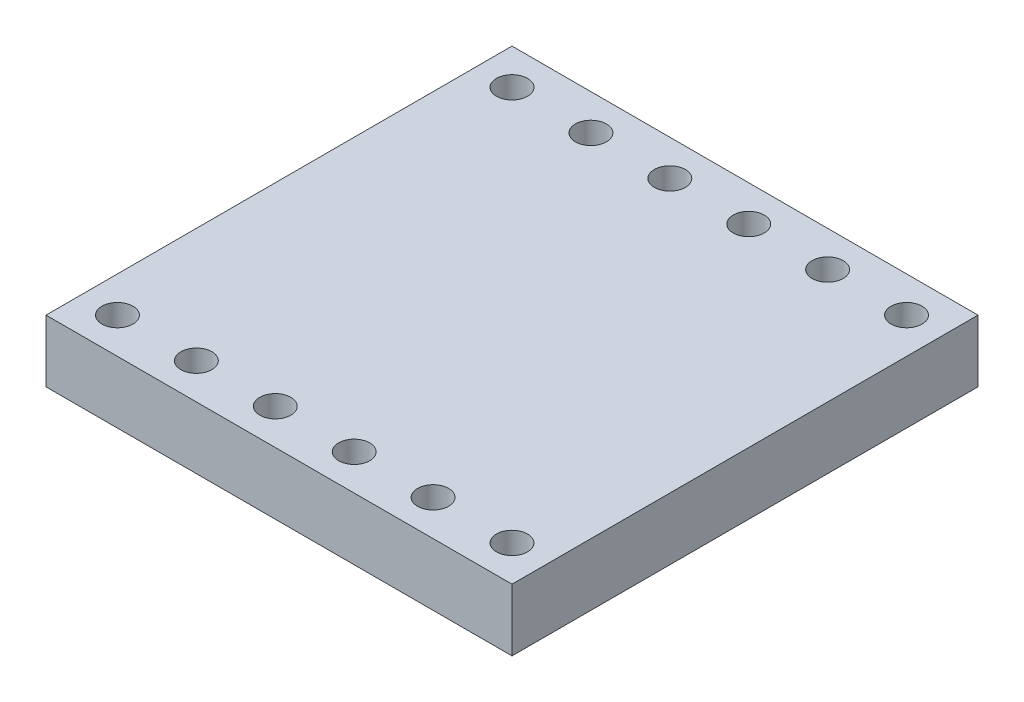
ISO-10303-21;
HEADER;
FILE_DESCRIPTION(('STEP AP214'),'2;1');
FILE_NAME('part.step','',(''),(''),'','','');
FILE_SCHEMA(('AUTOMOTIVE_DESIGN { 1 0 10303 214 1 1 1 1 }'));
ENDSEC;
DATA;
#1=APPLICATION_CONTEXT('core data for automotive mechanical design processes');
#2=APPLICATION_PROTOCOL_DEFINITION('international standard','automotive_design',2000,#1);
#3=PRODUCT_CONTEXT('',#1,'mechanical');
#4=PRODUCT('Part','Part','',(#3));
#5=PRODUCT_RELATED_PRODUCT_CATEGORY('part','',(#4));
#6=PRODUCT_DEFINITION_FORMATION('','',#4);
#7=PRODUCT_DEFINITION_CONTEXT('part definition',#1,'design');
#8=PRODUCT_DEFINITION('design','',#6,#7);
#9=PRODUCT_DEFINITION_SHAPE('','',#8);
#10=(LENGTH_UNIT() NAMED_UNIT(*) SI_UNIT(.MILLI.,.METRE.));
#11=(NAMED_UNIT(*) PLANE_ANGLE_UNIT() SI_UNIT($,.RADIAN.));
#12=(NAMED_UNIT(*) SI_UNIT($,.STERADIAN.) SOLID_ANGLE_UNIT());
#13=UNCERTAINTY_MEASURE_WITH_UNIT(LENGTH_MEASURE(1.E-05),#10,'distance_accuracy_value','');
#14=(GEOMETRIC_REPRESENTATION_CONTEXT(3) GLOBAL_UNCERTAINTY_ASSIGNED_CONTEXT((#13)) GLOBAL_UNIT_ASSIGNED_CONTEXT((#10,
#11,#12)) REPRESENTATION_CONTEXT('',''));
#15=CARTESIAN_POINT('',(0.,0.,0.));
#16=DIRECTION('',(0.,0.,1.));
#17=DIRECTION('',(1.,0.,0.));
#18=AXIS2_PLACEMENT_3D('',#15,#16,#17);
#19=CARTESIAN_POINT('',(0.,2.,0.));
#20=DIRECTION('',(1.,0.,0.));
#21=DIRECTION('',(0.,0.,-1.));
#22=AXIS2_PLACEMENT_3D('',#19,#20,#21);
#23=PLANE('',#22);
#24=DIRECTION('',(0.,0.,1.));
#25=VECTOR('',#24,1.);
#26=CARTESIAN_POINT('',(0.,0.,0.));
#27=LINE('',#26,#25);
#28=CARTESIAN_POINT('',(0.,0.,-15.));
#29=VERTEX_POINT('',#28);
#30=CARTESIAN_POINT('',(0.,0.,0.));
#31=VERTEX_POINT('',#30);
#32=EDGE_CURVE('E106',#29,#31,#27,.T.);
#33=ORIENTED_EDGE('',*,*,#32,.T.);
#34=DIRECTION('',(0.,-1.,0.));
#35=VECTOR('',#34,1.);
#36=CARTESIAN_POINT('',(0.,2.,0.));
#37=LINE('',#36,#35);
#38=CARTESIAN_POINT('',(0.,2.,0.));
#39=VERTEX_POINT('',#38);
#40=EDGE_CURVE('E11',#39,#31,#37,.T.);
#41=ORIENTED_EDGE('',*,*,#40,.F.);
#42=DIRECTION('',(0.,0.,1.));
#43=VECTOR('',#42,1.);
#44=CARTESIAN_POINT('',(0.,2.,0.));
#45=LINE('',#44,#43);
#46=CARTESIAN_POINT('',(0.,2.,-15.));
#47=VERTEX_POINT('',#46);
#48=EDGE_CURVE('E90',#47,#39,#45,.T.);
#49=ORIENTED_EDGE('',*,*,#48,.F.);
#50=DIRECTION('',(0.,-1.,0.));
#51=VECTOR('',#50,1.);
#52=CARTESIAN_POINT('',(0.,2.,-15.));
#53=LINE('',#52,#51);
#54=EDGE_CURVE('E102',#47,#29,#53,.T.);
#55=ORIENTED_EDGE('',*,*,#54,.T.);
#56=EDGE_LOOP('',(#33,#41,#49,#55));
#57=FACE_BOUND('',#56,.T.);
#58=ADVANCED_FACE('F38',(#57),#23,.F.);
#59=CARTESIAN_POINT('',(0.,2.,0.));
#60=DIRECTION('',(0.,0.,-1.));
#61=DIRECTION('',(-1.,0.,0.));
#62=AXIS2_PLACEMENT_3D('',#59,#60,#61);
#63=PLANE('',#62);
#64=DIRECTION('',(1.,0.,0.));
#65=VECTOR('',#64,1.);
#66=CARTESIAN_POINT('',(0.,0.,0.));
#67=LINE('',#66,#65);
#68=CARTESIAN_POINT('',(15.,0.,0.));
#69=VERTEX_POINT('',#68);
#70=EDGE_CURVE('E95',#31,#69,#67,.T.);
#71=ORIENTED_EDGE('',*,*,#70,.T.);
#72=DIRECTION('',(0.,-1.,0.));
#73=VECTOR('',#72,1.);
#74=CARTESIAN_POINT('',(15.,2.,0.));
#75=LINE('',#74,#73);
#76=CARTESIAN_POINT('',(15.,2.,0.));
#77=VERTEX_POINT('',#76);
#78=EDGE_CURVE('E47',#77,#69,#75,.T.);
#79=ORIENTED_EDGE('',*,*,#78,.F.);
#80=DIRECTION('',(1.,0.,0.));
#81=VECTOR('',#80,1.);
#82=CARTESIAN_POINT('',(0.,2.,0.));
#83=LINE('',#82,#81);
#84=EDGE_CURVE('E85',#39,#77,#83,.T.);
#85=ORIENTED_EDGE('',*,*,#84,.F.);
#86=ORIENTED_EDGE('',*,*,#40,.T.);
#87=EDGE_LOOP('',(#71,#79,#85,#86));
#88=FACE_BOUND('',#87,.T.);
#89=ADVANCED_FACE('F94',(#88),#63,.F.);
#90=CARTESIAN_POINT('',(15.,2.,0.));
#91=DIRECTION('',(-1.,0.,0.));
#92=DIRECTION('',(0.,0.,1.));
#93=AXIS2_PLACEMENT_3D('',#90,#91,#92);
#94=PLANE('',#93);
#95=DIRECTION('',(0.,0.,-1.));
#96=VECTOR('',#95,1.);
#97=CARTESIAN_POINT('',(15.,0.,0.));
#98=LINE('',#97,#96);
#99=CARTESIAN_POINT('',(15.,0.,-15.));
#100=VERTEX_POINT('',#99);
#101=EDGE_CURVE('E72',#69,#100,#98,.T.);
#102=ORIENTED_EDGE('',*,*,#101,.T.);
#103=DIRECTION('',(0.,-1.,0.));
#104=VECTOR('',#103,1.);
#105=CARTESIAN_POINT('',(15.,2.,-15.));
#106=LINE('',#105,#104);
#107=CARTESIAN_POINT('',(15.,2.,-15.));
#108=VERTEX_POINT('',#107);
#109=EDGE_CURVE('E97',#108,#100,#106,.T.);
#110=ORIENTED_EDGE('',*,*,#109,.F.);
#111=DIRECTION('',(0.,0.,-1.));
#112=VECTOR('',#111,1.);
#113=CARTESIAN_POINT('',(15.,2.,0.));
#114=LINE('',#113,#112);
#115=EDGE_CURVE('E88',#77,#108,#114,.T.);
#116=ORIENTED_EDGE('',*,*,#115,.F.);
#117=ORIENTED_EDGE('',*,*,#78,.T.);
#118=EDGE_LOOP('',(#102,#110,#116,#117));
#119=FACE_BOUND('',#118,.T.);
#120=ADVANCED_FACE('F98',(#119),#94,.F.);
#121=CARTESIAN_POINT('',(0.,2.,-15.));
#122=DIRECTION('',(0.,0.,1.));
#123=DIRECTION('',(1.,0.,0.));
#124=AXIS2_PLACEMENT_3D('',#121,#122,#123);
#125=PLANE('',#124);
#126=DIRECTION('',(-1.,0.,0.));
#127=VECTOR('',#126,1.);
#128=CARTESIAN_POINT('',(0.,0.,-15.));
#129=LINE('',#128,#127);
#130=EDGE_CURVE('E78',#100,#29,#129,.T.);
#131=ORIENTED_EDGE('',*,*,#130,.T.);
#132=ORIENTED_EDGE('',*,*,#54,.F.);
#133=DIRECTION('',(-1.,0.,0.));
#134=VECTOR('',#133,1.);
#135=CARTESIAN_POINT('',(0.,2.,-15.));
#136=LINE('',#135,#134);
#137=EDGE_CURVE('E55',#108,#47,#136,.T.);
#138=ORIENTED_EDGE('',*,*,#137,.F.);
#139=ORIENTED_EDGE('',*,*,#109,.T.);
#140=EDGE_LOOP('',(#131,#132,#138,#139));
#141=FACE_BOUND('',#140,.T.);
#142=ADVANCED_FACE('F120',(#141),#125,.F.);
#143=CARTESIAN_POINT('',(0.,2.,0.));
#144=DIRECTION('',(0.,-1.,0.));
#145=DIRECTION('',(0.,0.,-1.));
#146=AXIS2_PLACEMENT_3D('',#143,#144,#145);
#147=PLANE('',#146);
#148=CARTESIAN_POINT('',(1.15,2.,-1.15));
#149=DIRECTION('',(0.,1.,0.));
#150=DIRECTION('',(0.,0.,1.));
#151=AXIS2_PLACEMENT_3D('',#148,#149,#150);
#152=CIRCLE('',#151,0.5);
#153=CARTESIAN_POINT('',(1.15,2.,-0.65));
#154=VERTEX_POINT('',#153);
#155=EDGE_CURVE('E171',#154,#154,#152,.T.);
#156=ORIENTED_EDGE('',*,*,#155,.F.);
#157=EDGE_LOOP('',(#156));
#158=FACE_BOUND('',#157,.T.);
#159=CARTESIAN_POINT('',(13.85,2.,-13.85));
#160=DIRECTION('',(0.,1.,0.));
#161=DIRECTION('',(0.,0.,1.));
#162=AXIS2_PLACEMENT_3D('',#159,#160,#161);
#163=CIRCLE('',#162,0.500000000000001);
#164=CARTESIAN_POINT('',(13.85,2.,-13.35));
#165=VERTEX_POINT('',#164);
#166=EDGE_CURVE('E172',#165,#165,#163,.T.);
#167=ORIENTED_EDGE('',*,*,#166,.F.);
#168=EDGE_LOOP('',(#167));
#169=FACE_BOUND('',#168,.T.);
#170=CARTESIAN_POINT('',(11.31,2.,-13.85));
#171=DIRECTION('',(0.,1.,0.));
#172=DIRECTION('',(0.,0.,1.));
#173=AXIS2_PLACEMENT_3D('',#170,#171,#172);
#174=CIRCLE('',#173,0.500000000000001);
#175=CARTESIAN_POINT('',(11.31,2.,-13.35));
#176=VERTEX_POINT('',#175);
#177=EDGE_CURVE('E187',#176,#176,#174,.T.);
#178=ORIENTED_EDGE('',*,*,#177,.F.);
#179=EDGE_LOOP('',(#178));
#180=FACE_BOUND('',#179,.T.);
#181=CARTESIAN_POINT('',(8.77,2.,-13.85));
#182=DIRECTION('',(0.,1.,0.));
#183=DIRECTION('',(0.,0.,1.));
#184=AXIS2_PLACEMENT_3D('',#181,#182,#183);
#185=CIRCLE('',#184,0.500000000000001);
#186=CARTESIAN_POINT('',(8.77,2.,-13.35));
#187=VERTEX_POINT('',#186);
#188=EDGE_CURVE('E188',#187,#187,#185,.T.);
#189=ORIENTED_EDGE('',*,*,#188,.F.);
#190=EDGE_LOOP('',(#189));
#191=FACE_BOUND('',#190,.T.);
#192=CARTESIAN_POINT('',(3.69,2.,-1.15));
#193=DIRECTION('',(0.,1.,0.));
#194=DIRECTION('',(0.,0.,1.));
#195=AXIS2_PLACEMENT_3D('',#192,#193,#194);
#196=CIRCLE('',#195,0.500000000000001);
#197=CARTESIAN_POINT('',(3.69,2.,-0.65));
#198=VERTEX_POINT('',#197);
#199=EDGE_CURVE('E140',#198,#198,#196,.T.);
#200=ORIENTED_EDGE('',*,*,#199,.F.);
#201=EDGE_LOOP('',(#200));
#202=FACE_BOUND('',#201,.T.);
#203=CARTESIAN_POINT('',(6.23,2.,-1.15));
#204=DIRECTION('',(0.,1.,0.));
#205=DIRECTION('',(0.,0.,1.));
#206=AXIS2_PLACEMENT_3D('',#203,#204,#205);
#207=CIRCLE('',#206,0.500000000000001);
#208=CARTESIAN_POINT('',(6.23,2.,-0.65));
#209=VERTEX_POINT('',#208);
#210=EDGE_CURVE('E139',#209,#209,#207,.T.);
#211=ORIENTED_EDGE('',*,*,#210,.F.);
#212=EDGE_LOOP('',(#211));
#213=FACE_BOUND('',#212,.T.);
#214=CARTESIAN_POINT('',(8.77,2.,-1.15));
#215=DIRECTION('',(0.,1.,0.));
#216=DIRECTION('',(0.,0.,1.));
#217=AXIS2_PLACEMENT_3D('',#214,#215,#216);
#218=CIRCLE('',#217,0.500000000000001);
#219=CARTESIAN_POINT('',(8.77,2.,-0.65));
#220=VERTEX_POINT('',#219);
#221=EDGE_CURVE('E149',#220,#220,#218,.T.);
#222=ORIENTED_EDGE('',*,*,#221,.F.);
#223=EDGE_LOOP('',(#222));
#224=FACE_BOUND('',#223,.T.);
#225=CARTESIAN_POINT('',(11.31,2.,-1.15));
#226=DIRECTION('',(0.,1.,0.));
#227=DIRECTION('',(0.,0.,1.));
#228=AXIS2_PLACEMENT_3D('',#225,#226,#227);
#229=CIRCLE('',#228,0.500000000000001);
#230=CARTESIAN_POINT('',(11.31,2.,-0.65));
#231=VERTEX_POINT('',#230);
#232=EDGE_CURVE('E157',#231,#231,#229,.T.);
#233=ORIENTED_EDGE('',*,*,#232,.F.);
#234=EDGE_LOOP('',(#233));
#235=FACE_BOUND('',#234,.T.);
#236=CARTESIAN_POINT('',(6.23,2.,-13.85));
#237=DIRECTION('',(0.,1.,0.));
#238=DIRECTION('',(0.,0.,1.));
#239=AXIS2_PLACEMENT_3D('',#236,#237,#238);
#240=CIRCLE('',#239,0.500000000000001);
#241=CARTESIAN_POINT('',(6.23,2.,-13.35));
#242=VERTEX_POINT('',#241);
#243=EDGE_CURVE('E212',#242,#242,#240,.T.);
#244=ORIENTED_EDGE('',*,*,#243,.F.);
#245=EDGE_LOOP('',(#244));
#246=FACE_BOUND('',#245,.T.);
#247=CARTESIAN_POINT('',(3.69,2.,-13.85));
#248=DIRECTION('',(0.,1.,0.));
#249=DIRECTION('',(0.,0.,1.));
#250=AXIS2_PLACEMENT_3D('',#247,#248,#249);
#251=CIRCLE('',#250,0.500000000000001);
#252=CARTESIAN_POINT('',(3.69,2.,-13.35));
#253=VERTEX_POINT('',#252);
#254=EDGE_CURVE('E203',#253,#253,#251,.T.);
#255=ORIENTED_EDGE('',*,*,#254,.F.);
#256=EDGE_LOOP('',(#255));
#257=FACE_BOUND('',#256,.T.);
#258=CARTESIAN_POINT('',(1.15,2.,-13.85));
#259=DIRECTION('',(0.,1.,0.));
#260=DIRECTION('',(0.,0.,1.));
#261=AXIS2_PLACEMENT_3D('',#258,#259,#260);
#262=CIRCLE('',#261,0.5);
#263=CARTESIAN_POINT('',(1.15,2.,-13.35));
#264=VERTEX_POINT('',#263);
#265=EDGE_CURVE('E204',#264,#264,#262,.T.);
#266=ORIENTED_EDGE('',*,*,#265,.F.);
#267=EDGE_LOOP('',(#266));
#268=FACE_BOUND('',#267,.T.);
#269=CARTESIAN_POINT('',(13.85,2.,-1.15));
#270=DIRECTION('',(0.,1.,0.));
#271=DIRECTION('',(0.,0.,1.));
#272=AXIS2_PLACEMENT_3D('',#269,#270,#271);
#273=CIRCLE('',#272,0.500000000000001);
#274=CARTESIAN_POINT('',(13.85,2.,-0.65));
#275=VERTEX_POINT('',#274);
#276=EDGE_CURVE('E130',#275,#275,#273,.T.);
#277=ORIENTED_EDGE('',*,*,#276,.F.);
#278=EDGE_LOOP('',(#277));
#279=FACE_BOUND('',#278,.T.);
#280=ORIENTED_EDGE('',*,*,#48,.T.);
#281=ORIENTED_EDGE('',*,*,#84,.T.);
#282=ORIENTED_EDGE('',*,*,#115,.T.);
#283=ORIENTED_EDGE('',*,*,#137,.T.);
#284=EDGE_LOOP('',(#280,#281,#282,#283));
#285=FACE_BOUND('',#284,.T.);
#286=ADVANCED_FACE('F86',(#158,#169,#180,#191,#202,#213,#224,#235,#246,#257,#268,#279,#285),
#147,.F.);
#287=CARTESIAN_POINT('',(0.,0.,0.));
#288=DIRECTION('',(0.,-1.,0.));
#289=DIRECTION('',(0.,0.,-1.));
#290=AXIS2_PLACEMENT_3D('',#287,#288,#289);
#291=PLANE('',#290);
#292=CARTESIAN_POINT('',(1.15,0.,-1.15));
#293=DIRECTION('',(0.,-1.,0.));
#294=DIRECTION('',(0.,0.,-1.));
#295=AXIS2_PLACEMENT_3D('',#292,#293,#294);
#296=CIRCLE('',#295,0.5);
#297=CARTESIAN_POINT('',(1.15,0.,-1.65));
#298=VERTEX_POINT('',#297);
#299=EDGE_CURVE('E144',#298,#298,#296,.F.);
#300=ORIENTED_EDGE('',*,*,#299,.T.);
#301=EDGE_LOOP('',(#300));
#302=FACE_BOUND('',#301,.T.);
#303=CARTESIAN_POINT('',(13.85,0.,-13.85));
#304=DIRECTION('',(0.,-1.,0.));
#305=DIRECTION('',(0.,0.,-1.));
#306=AXIS2_PLACEMENT_3D('',#303,#304,#305);
#307=CIRCLE('',#306,0.500000000000001);
#308=CARTESIAN_POINT('',(13.85,0.,-14.35));
#309=VERTEX_POINT('',#308);
#310=EDGE_CURVE('E167',#309,#309,#307,.F.);
#311=ORIENTED_EDGE('',*,*,#310,.T.);
#312=EDGE_LOOP('',(#311));
#313=FACE_BOUND('',#312,.T.);
#314=CARTESIAN_POINT('',(11.31,0.,-13.85));
#315=DIRECTION('',(0.,-1.,0.));
#316=DIRECTION('',(0.,0.,-1.));
#317=AXIS2_PLACEMENT_3D('',#314,#315,#316);
#318=CIRCLE('',#317,0.500000000000001);
#319=CARTESIAN_POINT('',(11.31,0.,-14.35));
#320=VERTEX_POINT('',#319);
#321=EDGE_CURVE('E176',#320,#320,#318,.F.);
#322=ORIENTED_EDGE('',*,*,#321,.T.);
#323=EDGE_LOOP('',(#322));
#324=FACE_BOUND('',#323,.T.);
#325=CARTESIAN_POINT('',(8.77,0.,-13.85));
#326=DIRECTION('',(0.,-1.,0.));
#327=DIRECTION('',(0.,0.,-1.));
#328=AXIS2_PLACEMENT_3D('',#325,#326,#327);
#329=CIRCLE('',#328,0.500000000000001);
#330=CARTESIAN_POINT('',(8.77,0.,-14.35));
#331=VERTEX_POINT('',#330);
#332=EDGE_CURVE('E183',#331,#331,#329,.F.);
#333=ORIENTED_EDGE('',*,*,#332,.T.);
#334=EDGE_LOOP('',(#333));
#335=FACE_BOUND('',#334,.T.);
#336=CARTESIAN_POINT('',(3.69,0.,-1.15));
#337=DIRECTION('',(0.,-1.,0.));
#338=DIRECTION('',(0.,0.,-1.));
#339=AXIS2_PLACEMENT_3D('',#336,#337,#338);
#340=CIRCLE('',#339,0.500000000000001);
#341=CARTESIAN_POINT('',(3.69,0.,-1.65));
#342=VERTEX_POINT('',#341);
#343=EDGE_CURVE('E135',#342,#342,#340,.F.);
#344=ORIENTED_EDGE('',*,*,#343,.T.);
#345=EDGE_LOOP('',(#344));
#346=FACE_BOUND('',#345,.T.);
#347=CARTESIAN_POINT('',(6.23,0.,-1.15));
#348=DIRECTION('',(0.,-1.,0.));
#349=DIRECTION('',(0.,0.,-1.));
#350=AXIS2_PLACEMENT_3D('',#347,#348,#349);
#351=CIRCLE('',#350,0.500000000000001);
#352=CARTESIAN_POINT('',(6.23,0.,-1.65));
#353=VERTEX_POINT('',#352);
#354=EDGE_CURVE('E145',#353,#353,#351,.F.);
#355=ORIENTED_EDGE('',*,*,#354,.T.);
#356=EDGE_LOOP('',(#355));
#357=FACE_BOUND('',#356,.T.);
#358=CARTESIAN_POINT('',(8.77,0.,-1.15));
#359=DIRECTION('',(0.,-1.,0.));
#360=DIRECTION('',(0.,0.,-1.));
#361=AXIS2_PLACEMENT_3D('',#358,#359,#360);
#362=CIRCLE('',#361,0.500000000000001);
#363=CARTESIAN_POINT('',(8.77,0.,-1.65));
#364=VERTEX_POINT('',#363);
#365=EDGE_CURVE('E153',#364,#364,#362,.F.);
#366=ORIENTED_EDGE('',*,*,#365,.T.);
#367=EDGE_LOOP('',(#366));
#368=FACE_BOUND('',#367,.T.);
#369=CARTESIAN_POINT('',(11.31,0.,-1.15));
#370=DIRECTION('',(0.,-1.,0.));
#371=DIRECTION('',(0.,0.,-1.));
#372=AXIS2_PLACEMENT_3D('',#369,#370,#371);
#373=CIRCLE('',#372,0.500000000000001);
#374=CARTESIAN_POINT('',(11.31,0.,-1.65));
#375=VERTEX_POINT('',#374);
#376=EDGE_CURVE('E134',#375,#375,#373,.F.);
#377=ORIENTED_EDGE('',*,*,#376,.T.);
#378=EDGE_LOOP('',(#377));
#379=FACE_BOUND('',#378,.T.);
#380=CARTESIAN_POINT('',(6.23,0.,-13.85));
#381=DIRECTION('',(0.,-1.,0.));
#382=DIRECTION('',(0.,0.,-1.));
#383=AXIS2_PLACEMENT_3D('',#380,#381,#382);
#384=CIRCLE('',#383,0.500000000000001);
#385=CARTESIAN_POINT('',(6.23,0.,-14.35));
#386=VERTEX_POINT('',#385);
#387=EDGE_CURVE('E192',#386,#386,#384,.F.);
#388=ORIENTED_EDGE('',*,*,#387,.T.);
#389=EDGE_LOOP('',(#388));
#390=FACE_BOUND('',#389,.T.);
#391=CARTESIAN_POINT('',(3.69,0.,-13.85));
#392=DIRECTION('',(0.,-1.,0.));
#393=DIRECTION('',(0.,0.,-1.));
#394=AXIS2_PLACEMENT_3D('',#391,#392,#393);
#395=CIRCLE('',#394,0.500000000000001);
#396=CARTESIAN_POINT('',(3.69,0.,-14.35));
#397=VERTEX_POINT('',#396);
#398=EDGE_CURVE('E208',#397,#397,#395,.F.);
#399=ORIENTED_EDGE('',*,*,#398,.T.);
#400=EDGE_LOOP('',(#399));
#401=FACE_BOUND('',#400,.T.);
#402=CARTESIAN_POINT('',(1.15,0.,-13.85));
#403=DIRECTION('',(0.,-1.,0.));
#404=DIRECTION('',(0.,0.,-1.));
#405=AXIS2_PLACEMENT_3D('',#402,#403,#404);
#406=CIRCLE('',#405,0.5);
#407=CARTESIAN_POINT('',(1.15,0.,-14.35));
#408=VERTEX_POINT('',#407);
#409=EDGE_CURVE('E199',#408,#408,#406,.F.);
#410=ORIENTED_EDGE('',*,*,#409,.T.);
#411=EDGE_LOOP('',(#410));
#412=FACE_BOUND('',#411,.T.);
#413=CARTESIAN_POINT('',(13.85,0.,-1.15));
#414=DIRECTION('',(0.,-1.,0.));
#415=DIRECTION('',(0.,0.,-1.));
#416=AXIS2_PLACEMENT_3D('',#413,#414,#415);
#417=CIRCLE('',#416,0.500000000000001);
#418=CARTESIAN_POINT('',(13.85,0.,-1.65));
#419=VERTEX_POINT('',#418);
#420=EDGE_CURVE('E110',#419,#419,#417,.F.);
#421=ORIENTED_EDGE('',*,*,#420,.T.);
#422=EDGE_LOOP('',(#421));
#423=FACE_BOUND('',#422,.T.);
#424=ORIENTED_EDGE('',*,*,#32,.F.);
#425=ORIENTED_EDGE('',*,*,#130,.F.);
#426=ORIENTED_EDGE('',*,*,#101,.F.);
#427=ORIENTED_EDGE('',*,*,#70,.F.);
#428=EDGE_LOOP('',(#424,#425,#426,#427));
#429=FACE_BOUND('',#428,.T.);
#430=ADVANCED_FACE('F123',(#302,#313,#324,#335,#346,#357,#368,#379,#390,#401,#412,#423,#429),
#291,.T.);
#431=CARTESIAN_POINT('',(13.85,-1.4142135623731,-1.15));
#432=DIRECTION('',(0.,1.,0.));
#433=DIRECTION('',(0.,0.,1.));
#434=AXIS2_PLACEMENT_3D('',#431,#432,#433);
#435=CYLINDRICAL_SURFACE('',#434,0.500000000000001);
#436=ORIENTED_EDGE('',*,*,#276,.T.);
#437=EDGE_LOOP('',(#436));
#438=FACE_BOUND('',#437,.T.);
#439=ORIENTED_EDGE('',*,*,#420,.F.);
#440=EDGE_LOOP('',(#439));
#441=FACE_BOUND('',#440,.T.);
#442=ADVANCED_FACE('F236',(#438,#441),#435,.F.);
#443=CARTESIAN_POINT('',(1.15,-1.4142135623731,-13.85));
#444=DIRECTION('',(0.,1.,0.));
#445=DIRECTION('',(0.,0.,1.));
#446=AXIS2_PLACEMENT_3D('',#443,#444,#445);
#447=CYLINDRICAL_SURFACE('',#446,0.5);
#448=ORIENTED_EDGE('',*,*,#265,.T.);
#449=EDGE_LOOP('',(#448));
#450=FACE_BOUND('',#449,.T.);
#451=ORIENTED_EDGE('',*,*,#409,.F.);
#452=EDGE_LOOP('',(#451));
#453=FACE_BOUND('',#452,.T.);
#454=ADVANCED_FACE('F239',(#450,#453),#447,.F.);
#455=CARTESIAN_POINT('',(3.69,-1.4142135623731,-13.85));
#456=DIRECTION('',(0.,1.,0.));
#457=DIRECTION('',(0.,0.,1.));
#458=AXIS2_PLACEMENT_3D('',#455,#456,#457);
#459=CYLINDRICAL_SURFACE('',#458,0.500000000000001);
#460=ORIENTED_EDGE('',*,*,#254,.T.);
#461=EDGE_LOOP('',(#460));
#462=FACE_BOUND('',#461,.T.);
#463=ORIENTED_EDGE('',*,*,#398,.F.);
#464=EDGE_LOOP('',(#463));
#465=FACE_BOUND('',#464,.T.);
#466=ADVANCED_FACE('F283',(#462,#465),#459,.F.);
#467=CARTESIAN_POINT('',(6.23,-1.4142135623731,-13.85));
#468=DIRECTION('',(0.,1.,0.));
#469=DIRECTION('',(0.,0.,1.));
#470=AXIS2_PLACEMENT_3D('',#467,#468,#469);
#471=CYLINDRICAL_SURFACE('',#470,0.500000000000001);
#472=ORIENTED_EDGE('',*,*,#243,.T.);
#473=EDGE_LOOP('',(#472));
#474=FACE_BOUND('',#473,.T.);
#475=ORIENTED_EDGE('',*,*,#387,.F.);
#476=EDGE_LOOP('',(#475));
#477=FACE_BOUND('',#476,.T.);
#478=ADVANCED_FACE('F223',(#474,#477),#471,.F.);
#479=CARTESIAN_POINT('',(11.31,-1.4142135623731,-1.15));
#480=DIRECTION('',(0.,1.,0.));
#481=DIRECTION('',(0.,0.,1.));
#482=AXIS2_PLACEMENT_3D('',#479,#480,#481);
#483=CYLINDRICAL_SURFACE('',#482,0.500000000000001);
#484=ORIENTED_EDGE('',*,*,#232,.T.);
#485=EDGE_LOOP('',(#484));
#486=FACE_BOUND('',#485,.T.);
#487=ORIENTED_EDGE('',*,*,#376,.F.);
#488=EDGE_LOOP('',(#487));
#489=FACE_BOUND('',#488,.T.);
#490=ADVANCED_FACE('F298',(#486,#489),#483,.F.);
#491=CARTESIAN_POINT('',(8.77,-1.4142135623731,-1.15));
#492=DIRECTION('',(0.,1.,0.));
#493=DIRECTION('',(0.,0.,1.));
#494=AXIS2_PLACEMENT_3D('',#491,#492,#493);
#495=CYLINDRICAL_SURFACE('',#494,0.500000000000001);
#496=ORIENTED_EDGE('',*,*,#221,.T.);
#497=EDGE_LOOP('',(#496));
#498=FACE_BOUND('',#497,.T.);
#499=ORIENTED_EDGE('',*,*,#365,.F.);
#500=EDGE_LOOP('',(#499));
#501=FACE_BOUND('',#500,.T.);
#502=ADVANCED_FACE('F305',(#498,#501),#495,.F.);
#503=CARTESIAN_POINT('',(6.23,-1.4142135623731,-1.15));
#504=DIRECTION('',(0.,1.,0.));
#505=DIRECTION('',(0.,0.,1.));
#506=AXIS2_PLACEMENT_3D('',#503,#504,#505);
#507=CYLINDRICAL_SURFACE('',#506,0.500000000000001);
#508=ORIENTED_EDGE('',*,*,#210,.T.);
#509=EDGE_LOOP('',(#508));
#510=FACE_BOUND('',#509,.T.);
#511=ORIENTED_EDGE('',*,*,#354,.F.);
#512=EDGE_LOOP('',(#511));
#513=FACE_BOUND('',#512,.T.);
#514=ADVANCED_FACE('F313',(#510,#513),#507,.F.);
#515=CARTESIAN_POINT('',(3.69,-1.4142135623731,-1.15));
#516=DIRECTION('',(0.,1.,0.));
#517=DIRECTION('',(0.,0.,1.));
#518=AXIS2_PLACEMENT_3D('',#515,#516,#517);
#519=CYLINDRICAL_SURFACE('',#518,0.500000000000001);
#520=ORIENTED_EDGE('',*,*,#199,.T.);
#521=EDGE_LOOP('',(#520));
#522=FACE_BOUND('',#521,.T.);
#523=ORIENTED_EDGE('',*,*,#343,.F.);
#524=EDGE_LOOP('',(#523));
#525=FACE_BOUND('',#524,.T.);
#526=ADVANCED_FACE('F321',(#522,#525),#519,.F.);
#527=CARTESIAN_POINT('',(8.77,-1.4142135623731,-13.85));
#528=DIRECTION('',(0.,1.,0.));
#529=DIRECTION('',(0.,0.,1.));
#530=AXIS2_PLACEMENT_3D('',#527,#528,#529);
#531=CYLINDRICAL_SURFACE('',#530,0.500000000000001);
#532=ORIENTED_EDGE('',*,*,#188,.T.);
#533=EDGE_LOOP('',(#532));
#534=FACE_BOUND('',#533,.T.);
#535=ORIENTED_EDGE('',*,*,#332,.F.);
#536=EDGE_LOOP('',(#535));
#537=FACE_BOUND('',#536,.T.);
#538=ADVANCED_FACE('F329',(#534,#537),#531,.F.);
#539=CARTESIAN_POINT('',(11.31,-1.4142135623731,-13.85));
#540=DIRECTION('',(0.,1.,0.));
#541=DIRECTION('',(0.,0.,1.));
#542=AXIS2_PLACEMENT_3D('',#539,#540,#541);
#543=CYLINDRICAL_SURFACE('',#542,0.500000000000001);
#544=ORIENTED_EDGE('',*,*,#177,.T.);
#545=EDGE_LOOP('',(#544));
#546=FACE_BOUND('',#545,.T.);
#547=ORIENTED_EDGE('',*,*,#321,.F.);
#548=EDGE_LOOP('',(#547));
#549=FACE_BOUND('',#548,.T.);
#550=ADVANCED_FACE('F337',(#546,#549),#543,.F.);
#551=CARTESIAN_POINT('',(13.85,-1.4142135623731,-13.85));
#552=DIRECTION('',(0.,1.,0.));
#553=DIRECTION('',(0.,0.,1.));
#554=AXIS2_PLACEMENT_3D('',#551,#552,#553);
#555=CYLINDRICAL_SURFACE('',#554,0.500000000000001);
#556=ORIENTED_EDGE('',*,*,#166,.T.);
#557=EDGE_LOOP('',(#556));
#558=FACE_BOUND('',#557,.T.);
#559=ORIENTED_EDGE('',*,*,#310,.F.);
#560=EDGE_LOOP('',(#559));
#561=FACE_BOUND('',#560,.T.);
#562=ADVANCED_FACE('F345',(#558,#561),#555,.F.);
#563=CARTESIAN_POINT('',(1.15,-1.4142135623731,-1.15));
#564=DIRECTION('',(0.,1.,0.));
#565=DIRECTION('',(0.,0.,1.));
#566=AXIS2_PLACEMENT_3D('',#563,#564,#565);
#567=CYLINDRICAL_SURFACE('',#566,0.5);
#568=ORIENTED_EDGE('',*,*,#155,.T.);
#569=EDGE_LOOP('',(#568));
#570=FACE_BOUND('',#569,.T.);
#571=ORIENTED_EDGE('',*,*,#299,.F.);
#572=EDGE_LOOP('',(#571));
#573=FACE_BOUND('',#572,.T.);
#574=ADVANCED_FACE('F353',(#570,#573),#567,.F.);
#575=CLOSED_SHELL('',(#58,#89,#120,#142,#286,#430,#442,#454,#466,#478,#490,#502,#514,#526,#538,
#550,#562,#574));
#576=MANIFOLD_SOLID_BREP('B2',#575);
#577=ADVANCED_BREP_SHAPE_REPRESENTATION('',(#18,#576),#14);
#578=SHAPE_DEFINITION_REPRESENTATION(#9,#577);
ENDSEC;
END-ISO-10303-21;
